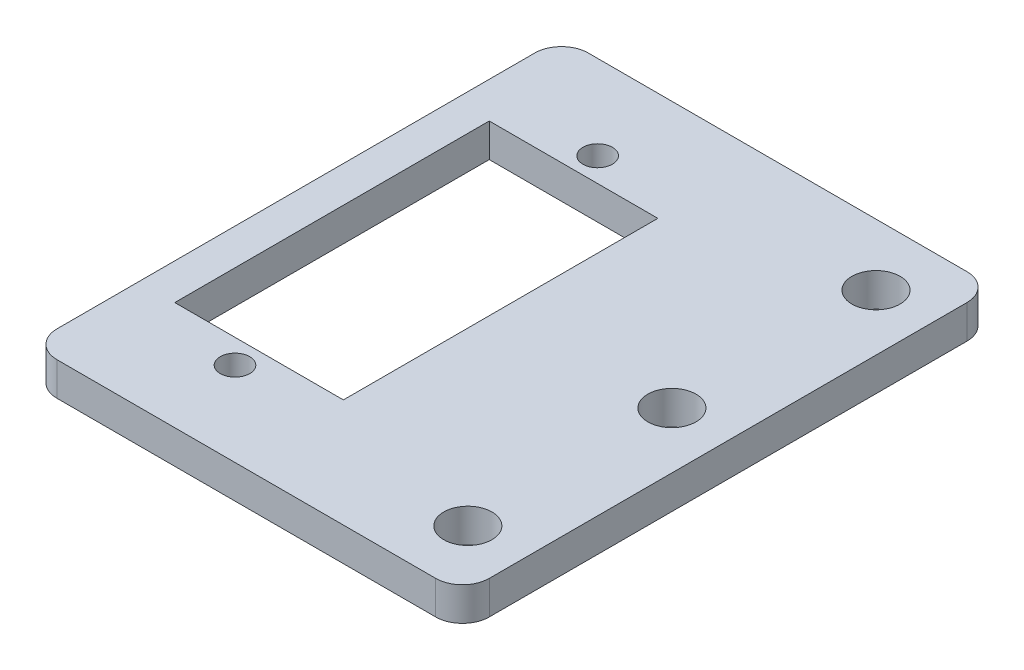
ISO-10303-21;
HEADER;
FILE_DESCRIPTION(('STEP AP214'),'2;1');
FILE_NAME('part.step','',(''),(''),'','','');
FILE_SCHEMA(('AUTOMOTIVE_DESIGN { 1 0 10303 214 1 1 1 1 }'));
ENDSEC;
DATA;
#1=APPLICATION_CONTEXT('core data for automotive mechanical design processes');
#2=APPLICATION_PROTOCOL_DEFINITION('international standard','automotive_design',2000,#1);
#3=PRODUCT_CONTEXT('',#1,'mechanical');
#4=PRODUCT('Part','Part','',(#3));
#5=PRODUCT_RELATED_PRODUCT_CATEGORY('part','',(#4));
#6=PRODUCT_DEFINITION_FORMATION('','',#4);
#7=PRODUCT_DEFINITION_CONTEXT('part definition',#1,'design');
#8=PRODUCT_DEFINITION('design','',#6,#7);
#9=PRODUCT_DEFINITION_SHAPE('','',#8);
#10=(LENGTH_UNIT() NAMED_UNIT(*) SI_UNIT(.MILLI.,.METRE.));
#11=(NAMED_UNIT(*) PLANE_ANGLE_UNIT() SI_UNIT($,.RADIAN.));
#12=(NAMED_UNIT(*) SI_UNIT($,.STERADIAN.) SOLID_ANGLE_UNIT());
#13=UNCERTAINTY_MEASURE_WITH_UNIT(LENGTH_MEASURE(1.E-05),#10,'distance_accuracy_value','');
#14=(GEOMETRIC_REPRESENTATION_CONTEXT(3) GLOBAL_UNCERTAINTY_ASSIGNED_CONTEXT((#13)) GLOBAL_UNIT_ASSIGNED_CONTEXT((#10,
#11,#12)) REPRESENTATION_CONTEXT('',''));
#15=CARTESIAN_POINT('',(0.,0.,0.));
#16=DIRECTION('',(0.,0.,1.));
#17=DIRECTION('',(1.,0.,0.));
#18=AXIS2_PLACEMENT_3D('',#15,#16,#17);
#19=CARTESIAN_POINT('',(0.,-2.5,0.));
#20=DIRECTION('',(0.,-1.,0.));
#21=DIRECTION('',(0.,0.,-1.));
#22=AXIS2_PLACEMENT_3D('',#19,#20,#21);
#23=PLANE('',#22);
#24=CARTESIAN_POINT('',(19.099999994,-2.5,15.25));
#25=DIRECTION('',(0.,1.,0.));
#26=DIRECTION('',(0.,0.,1.));
#27=AXIS2_PLACEMENT_3D('',#24,#25,#26);
#28=CIRCLE('',#27,1.8);
#29=CARTESIAN_POINT('',(19.099999994,-2.5,17.05));
#30=VERTEX_POINT('',#29);
#31=EDGE_CURVE('E449',#30,#30,#28,.T.);
#32=ORIENTED_EDGE('',*,*,#31,.T.);
#33=EDGE_LOOP('',(#32));
#34=FACE_BOUND('',#33,.T.);
#35=CARTESIAN_POINT('',(19.099999994,-2.5,0.));
#36=DIRECTION('',(0.,1.,0.));
#37=DIRECTION('',(0.,0.,1.));
#38=AXIS2_PLACEMENT_3D('',#35,#36,#37);
#39=CIRCLE('',#38,1.8);
#40=CARTESIAN_POINT('',(19.099999994,-2.5,1.8));
#41=VERTEX_POINT('',#40);
#42=EDGE_CURVE('E443',#41,#41,#39,.T.);
#43=ORIENTED_EDGE('',*,*,#42,.T.);
#44=EDGE_LOOP('',(#43));
#45=FACE_BOUND('',#44,.T.);
#46=CARTESIAN_POINT('',(19.099999994,-2.5,-15.25));
#47=DIRECTION('',(0.,1.,0.));
#48=DIRECTION('',(0.,0.,1.));
#49=AXIS2_PLACEMENT_3D('',#46,#47,#48);
#50=CIRCLE('',#49,1.8);
#51=CARTESIAN_POINT('',(19.099999994,-2.5,-13.45));
#52=VERTEX_POINT('',#51);
#53=EDGE_CURVE('E437',#52,#52,#50,.T.);
#54=ORIENTED_EDGE('',*,*,#53,.T.);
#55=EDGE_LOOP('',(#54));
#56=FACE_BOUND('',#55,.T.);
#57=CARTESIAN_POINT('',(0.,-2.5,13.55));
#58=DIRECTION('',(0.,1.,0.));
#59=DIRECTION('',(0.,0.,1.));
#60=AXIS2_PLACEMENT_3D('',#57,#58,#59);
#61=CIRCLE('',#60,1.1);
#62=CARTESIAN_POINT('',(0.,-2.5,14.65));
#63=VERTEX_POINT('',#62);
#64=EDGE_CURVE('E430',#63,#63,#61,.T.);
#65=ORIENTED_EDGE('',*,*,#64,.T.);
#66=EDGE_LOOP('',(#65));
#67=FACE_BOUND('',#66,.T.);
#68=DIRECTION('',(0.,0.,-1.));
#69=VECTOR('',#68,1.);
#70=CARTESIAN_POINT('',(23.299999994,-2.5,19.85));
#71=LINE('',#70,#69);
#72=CARTESIAN_POINT('',(23.299999994,-2.5,17.85));
#73=VERTEX_POINT('',#72);
#74=CARTESIAN_POINT('',(23.299999994,-2.5,-17.85));
#75=VERTEX_POINT('',#74);
#76=EDGE_CURVE('E177',#73,#75,#71,.T.);
#77=ORIENTED_EDGE('',*,*,#76,.F.);
#78=CARTESIAN_POINT('',(21.299999994,-2.5,17.85));
#79=DIRECTION('',(0.,-1.,0.));
#80=DIRECTION('',(0.,0.,-1.));
#81=AXIS2_PLACEMENT_3D('',#78,#79,#80);
#82=CIRCLE('',#81,2.);
#83=CARTESIAN_POINT('',(21.299999994,-2.5,19.85));
#84=VERTEX_POINT('',#83);
#85=EDGE_CURVE('E215',#73,#84,#82,.T.);
#86=ORIENTED_EDGE('',*,*,#85,.T.);
#87=DIRECTION('',(1.,0.,0.));
#88=VECTOR('',#87,1.);
#89=CARTESIAN_POINT('',(-9.,-2.5,19.85));
#90=LINE('',#89,#88);
#91=CARTESIAN_POINT('',(-7.,-2.5,19.85));
#92=VERTEX_POINT('',#91);
#93=EDGE_CURVE('E173',#92,#84,#90,.T.);
#94=ORIENTED_EDGE('',*,*,#93,.F.);
#95=CARTESIAN_POINT('',(-7.,-2.5,17.85));
#96=DIRECTION('',(0.,-1.,0.));
#97=DIRECTION('',(0.,0.,-1.));
#98=AXIS2_PLACEMENT_3D('',#95,#96,#97);
#99=CIRCLE('',#98,2.);
#100=CARTESIAN_POINT('',(-9.,-2.5,17.85));
#101=VERTEX_POINT('',#100);
#102=EDGE_CURVE('E210',#92,#101,#99,.T.);
#103=ORIENTED_EDGE('',*,*,#102,.T.);
#104=DIRECTION('',(0.,0.,1.));
#105=VECTOR('',#104,1.);
#106=CARTESIAN_POINT('',(-9.,-2.5,19.85));
#107=LINE('',#106,#105);
#108=CARTESIAN_POINT('',(-9.,-2.5,-17.85));
#109=VERTEX_POINT('',#108);
#110=EDGE_CURVE('E170',#109,#101,#107,.T.);
#111=ORIENTED_EDGE('',*,*,#110,.F.);
#112=CARTESIAN_POINT('',(-7.,-2.5,-17.85));
#113=DIRECTION('',(0.,-1.,0.));
#114=DIRECTION('',(0.,0.,-1.));
#115=AXIS2_PLACEMENT_3D('',#112,#113,#114);
#116=CIRCLE('',#115,2.);
#117=CARTESIAN_POINT('',(-7.,-2.5,-19.85));
#118=VERTEX_POINT('',#117);
#119=EDGE_CURVE('E49',#109,#118,#116,.T.);
#120=ORIENTED_EDGE('',*,*,#119,.T.);
#121=DIRECTION('',(-1.,0.,0.));
#122=VECTOR('',#121,1.);
#123=CARTESIAN_POINT('',(-9.,-2.5,-19.85));
#124=LINE('',#123,#122);
#125=CARTESIAN_POINT('',(21.299999994,-2.5,-19.85));
#126=VERTEX_POINT('',#125);
#127=EDGE_CURVE('E180',#126,#118,#124,.T.);
#128=ORIENTED_EDGE('',*,*,#127,.F.);
#129=CARTESIAN_POINT('',(21.299999994,-2.5,-17.85));
#130=DIRECTION('',(0.,-1.,0.));
#131=DIRECTION('',(0.,0.,-1.));
#132=AXIS2_PLACEMENT_3D('',#129,#130,#131);
#133=CIRCLE('',#132,2.);
#134=EDGE_CURVE('E213',#126,#75,#133,.T.);
#135=ORIENTED_EDGE('',*,*,#134,.T.);
#136=EDGE_LOOP('',(#77,#86,#94,#103,#111,#120,#128,#135));
#137=FACE_BOUND('',#136,.T.);
#138=DIRECTION('',(0.,0.,1.));
#139=VECTOR('',#138,1.);
#140=CARTESIAN_POINT('',(-6.3,-2.5,11.75));
#141=LINE('',#140,#139);
#142=CARTESIAN_POINT('',(-6.3,-2.5,-11.75));
#143=VERTEX_POINT('',#142);
#144=CARTESIAN_POINT('',(-6.3,-2.5,11.75));
#145=VERTEX_POINT('',#144);
#146=EDGE_CURVE('E128',#143,#145,#141,.T.);
#147=ORIENTED_EDGE('',*,*,#146,.T.);
#148=DIRECTION('',(1.,0.,0.));
#149=VECTOR('',#148,1.);
#150=CARTESIAN_POINT('',(-6.3,-2.5,11.75));
#151=LINE('',#150,#149);
#152=CARTESIAN_POINT('',(6.3,-2.5,11.75));
#153=VERTEX_POINT('',#152);
#154=EDGE_CURVE('E140',#145,#153,#151,.T.);
#155=ORIENTED_EDGE('',*,*,#154,.T.);
#156=DIRECTION('',(0.,0.,-1.));
#157=VECTOR('',#156,1.);
#158=CARTESIAN_POINT('',(6.3,-2.5,11.75));
#159=LINE('',#158,#157);
#160=CARTESIAN_POINT('',(6.3,-2.5,-11.75));
#161=VERTEX_POINT('',#160);
#162=EDGE_CURVE('E144',#153,#161,#159,.T.);
#163=ORIENTED_EDGE('',*,*,#162,.T.);
#164=DIRECTION('',(-1.,0.,0.));
#165=VECTOR('',#164,1.);
#166=CARTESIAN_POINT('',(-6.3,-2.5,-11.75));
#167=LINE('',#166,#165);
#168=EDGE_CURVE('E136',#161,#143,#167,.T.);
#169=ORIENTED_EDGE('',*,*,#168,.T.);
#170=EDGE_LOOP('',(#147,#155,#163,#169));
#171=FACE_BOUND('',#170,.T.);
#172=CARTESIAN_POINT('',(0.,-2.5,-13.55));
#173=DIRECTION('',(0.,1.,0.));
#174=DIRECTION('',(0.,0.,1.));
#175=AXIS2_PLACEMENT_3D('',#172,#173,#174);
#176=CIRCLE('',#175,1.1);
#177=CARTESIAN_POINT('',(0.,-2.5,-12.45));
#178=VERTEX_POINT('',#177);
#179=EDGE_CURVE('E154',#178,#178,#176,.T.);
#180=ORIENTED_EDGE('',*,*,#179,.T.);
#181=EDGE_LOOP('',(#180));
#182=FACE_BOUND('',#181,.T.);
#183=ADVANCED_FACE('F34',(#34,#45,#56,#67,#137,#171,#182),#23,.T.);
#184=CARTESIAN_POINT('',(0.,0.,0.));
#185=DIRECTION('',(0.,-1.,0.));
#186=DIRECTION('',(0.,0.,-1.));
#187=AXIS2_PLACEMENT_3D('',#184,#185,#186);
#188=PLANE('',#187);
#189=CARTESIAN_POINT('',(19.099999994,0.,15.25));
#190=DIRECTION('',(0.,1.,0.));
#191=DIRECTION('',(0.,0.,1.));
#192=AXIS2_PLACEMENT_3D('',#189,#190,#191);
#193=CIRCLE('',#192,1.8);
#194=CARTESIAN_POINT('',(19.099999994,0.,17.05));
#195=VERTEX_POINT('',#194);
#196=EDGE_CURVE('E451',#195,#195,#193,.T.);
#197=ORIENTED_EDGE('',*,*,#196,.F.);
#198=EDGE_LOOP('',(#197));
#199=FACE_BOUND('',#198,.T.);
#200=CARTESIAN_POINT('',(19.099999994,0.,0.));
#201=DIRECTION('',(0.,1.,0.));
#202=DIRECTION('',(0.,0.,1.));
#203=AXIS2_PLACEMENT_3D('',#200,#201,#202);
#204=CIRCLE('',#203,1.8);
#205=CARTESIAN_POINT('',(19.099999994,0.,1.8));
#206=VERTEX_POINT('',#205);
#207=EDGE_CURVE('E446',#206,#206,#204,.T.);
#208=ORIENTED_EDGE('',*,*,#207,.F.);
#209=EDGE_LOOP('',(#208));
#210=FACE_BOUND('',#209,.T.);
#211=CARTESIAN_POINT('',(19.099999994,0.,-15.25));
#212=DIRECTION('',(0.,1.,0.));
#213=DIRECTION('',(0.,0.,1.));
#214=AXIS2_PLACEMENT_3D('',#211,#212,#213);
#215=CIRCLE('',#214,1.8);
#216=CARTESIAN_POINT('',(19.099999994,0.,-13.45));
#217=VERTEX_POINT('',#216);
#218=EDGE_CURVE('E440',#217,#217,#215,.T.);
#219=ORIENTED_EDGE('',*,*,#218,.F.);
#220=EDGE_LOOP('',(#219));
#221=FACE_BOUND('',#220,.T.);
#222=CARTESIAN_POINT('',(0.,0.,13.55));
#223=DIRECTION('',(0.,1.,0.));
#224=DIRECTION('',(0.,0.,1.));
#225=AXIS2_PLACEMENT_3D('',#222,#223,#224);
#226=CIRCLE('',#225,1.09999999999999);
#227=CARTESIAN_POINT('',(0.,0.,14.65));
#228=VERTEX_POINT('',#227);
#229=EDGE_CURVE('E432',#228,#228,#226,.T.);
#230=ORIENTED_EDGE('',*,*,#229,.F.);
#231=EDGE_LOOP('',(#230));
#232=FACE_BOUND('',#231,.T.);
#233=DIRECTION('',(1.,0.,0.));
#234=VECTOR('',#233,1.);
#235=CARTESIAN_POINT('',(-6.3,0.,11.75));
#236=LINE('',#235,#234);
#237=CARTESIAN_POINT('',(-6.3,0.,11.75));
#238=VERTEX_POINT('',#237);
#239=CARTESIAN_POINT('',(6.3,0.,11.75));
#240=VERTEX_POINT('',#239);
#241=EDGE_CURVE('E160',#238,#240,#236,.T.);
#242=ORIENTED_EDGE('',*,*,#241,.F.);
#243=DIRECTION('',(0.,0.,1.));
#244=VECTOR('',#243,1.);
#245=CARTESIAN_POINT('',(-6.3,0.,11.75));
#246=LINE('',#245,#244);
#247=CARTESIAN_POINT('',(-6.3,0.,-11.75));
#248=VERTEX_POINT('',#247);
#249=EDGE_CURVE('E131',#248,#238,#246,.T.);
#250=ORIENTED_EDGE('',*,*,#249,.F.);
#251=DIRECTION('',(-1.,0.,0.));
#252=VECTOR('',#251,1.);
#253=CARTESIAN_POINT('',(-6.3,0.,-11.75));
#254=LINE('',#253,#252);
#255=CARTESIAN_POINT('',(6.3,0.,-11.75));
#256=VERTEX_POINT('',#255);
#257=EDGE_CURVE('E148',#256,#248,#254,.T.);
#258=ORIENTED_EDGE('',*,*,#257,.F.);
#259=DIRECTION('',(0.,0.,-1.));
#260=VECTOR('',#259,1.);
#261=CARTESIAN_POINT('',(6.3,0.,11.75));
#262=LINE('',#261,#260);
#263=EDGE_CURVE('E151',#240,#256,#262,.T.);
#264=ORIENTED_EDGE('',*,*,#263,.F.);
#265=EDGE_LOOP('',(#242,#250,#258,#264));
#266=FACE_BOUND('',#265,.T.);
#267=DIRECTION('',(1.,0.,0.));
#268=VECTOR('',#267,1.);
#269=CARTESIAN_POINT('',(-9.,0.,19.85));
#270=LINE('',#269,#268);
#271=CARTESIAN_POINT('',(-7.,0.,19.85));
#272=VERTEX_POINT('',#271);
#273=CARTESIAN_POINT('',(21.299999994,0.,19.85));
#274=VERTEX_POINT('',#273);
#275=EDGE_CURVE('E185',#272,#274,#270,.T.);
#276=ORIENTED_EDGE('',*,*,#275,.T.);
#277=CARTESIAN_POINT('',(21.299999994,0.,17.85));
#278=DIRECTION('',(0.,-1.,0.));
#279=DIRECTION('',(0.,0.,-1.));
#280=AXIS2_PLACEMENT_3D('',#277,#278,#279);
#281=CIRCLE('',#280,2.);
#282=CARTESIAN_POINT('',(23.299999994,0.,17.85));
#283=VERTEX_POINT('',#282);
#284=EDGE_CURVE('E203',#274,#283,#281,.F.);
#285=ORIENTED_EDGE('',*,*,#284,.T.);
#286=DIRECTION('',(0.,0.,-1.));
#287=VECTOR('',#286,1.);
#288=CARTESIAN_POINT('',(23.299999994,0.,19.85));
#289=LINE('',#288,#287);
#290=CARTESIAN_POINT('',(23.299999994,0.,-17.85));
#291=VERTEX_POINT('',#290);
#292=EDGE_CURVE('E188',#283,#291,#289,.T.);
#293=ORIENTED_EDGE('',*,*,#292,.T.);
#294=CARTESIAN_POINT('',(21.299999994,0.,-17.85));
#295=DIRECTION('',(0.,-1.,0.));
#296=DIRECTION('',(0.,0.,-1.));
#297=AXIS2_PLACEMENT_3D('',#294,#295,#296);
#298=CIRCLE('',#297,2.);
#299=CARTESIAN_POINT('',(21.299999994,0.,-19.85));
#300=VERTEX_POINT('',#299);
#301=EDGE_CURVE('E201',#291,#300,#298,.F.);
#302=ORIENTED_EDGE('',*,*,#301,.T.);
#303=DIRECTION('',(-1.,0.,0.));
#304=VECTOR('',#303,1.);
#305=CARTESIAN_POINT('',(-9.,0.,-19.85));
#306=LINE('',#305,#304);
#307=CARTESIAN_POINT('',(-7.,0.,-19.85));
#308=VERTEX_POINT('',#307);
#309=EDGE_CURVE('E174',#300,#308,#306,.T.);
#310=ORIENTED_EDGE('',*,*,#309,.T.);
#311=CARTESIAN_POINT('',(-7.,0.,-17.85));
#312=DIRECTION('',(0.,-1.,0.));
#313=DIRECTION('',(0.,0.,-1.));
#314=AXIS2_PLACEMENT_3D('',#311,#312,#313);
#315=CIRCLE('',#314,2.);
#316=CARTESIAN_POINT('',(-9.,0.,-17.85));
#317=VERTEX_POINT('',#316);
#318=EDGE_CURVE('E199',#308,#317,#315,.F.);
#319=ORIENTED_EDGE('',*,*,#318,.T.);
#320=DIRECTION('',(0.,0.,1.));
#321=VECTOR('',#320,1.);
#322=CARTESIAN_POINT('',(-9.,0.,19.85));
#323=LINE('',#322,#321);
#324=CARTESIAN_POINT('',(-9.,0.,17.85));
#325=VERTEX_POINT('',#324);
#326=EDGE_CURVE('E166',#317,#325,#323,.T.);
#327=ORIENTED_EDGE('',*,*,#326,.T.);
#328=CARTESIAN_POINT('',(-7.,0.,17.85));
#329=DIRECTION('',(0.,-1.,0.));
#330=DIRECTION('',(0.,0.,-1.));
#331=AXIS2_PLACEMENT_3D('',#328,#329,#330);
#332=CIRCLE('',#331,2.);
#333=EDGE_CURVE('E197',#325,#272,#332,.F.);
#334=ORIENTED_EDGE('',*,*,#333,.T.);
#335=EDGE_LOOP('',(#276,#285,#293,#302,#310,#319,#327,#334));
#336=FACE_BOUND('',#335,.T.);
#337=CARTESIAN_POINT('',(0.,0.,-13.55));
#338=DIRECTION('',(0.,1.,0.));
#339=DIRECTION('',(0.,0.,1.));
#340=AXIS2_PLACEMENT_3D('',#337,#338,#339);
#341=CIRCLE('',#340,1.09999999999999);
#342=CARTESIAN_POINT('',(0.,0.,-12.45));
#343=VERTEX_POINT('',#342);
#344=EDGE_CURVE('E429',#343,#343,#341,.T.);
#345=ORIENTED_EDGE('',*,*,#344,.F.);
#346=EDGE_LOOP('',(#345));
#347=FACE_BOUND('',#346,.T.);
#348=ADVANCED_FACE('F229',(#199,#210,#221,#232,#266,#336,#347),#188,.F.);
#349=CARTESIAN_POINT('',(-9.,-2.5,19.85));
#350=DIRECTION('',(-1.,0.,0.));
#351=DIRECTION('',(0.,0.,1.));
#352=AXIS2_PLACEMENT_3D('',#349,#350,#351);
#353=PLANE('',#352);
#354=ORIENTED_EDGE('',*,*,#326,.F.);
#355=DIRECTION('',(0.,1.,0.));
#356=VECTOR('',#355,1.);
#357=CARTESIAN_POINT('',(-9.,-2.5,-17.85));
#358=LINE('',#357,#356);
#359=EDGE_CURVE('E11',#317,#109,#358,.F.);
#360=ORIENTED_EDGE('',*,*,#359,.T.);
#361=ORIENTED_EDGE('',*,*,#110,.T.);
#362=DIRECTION('',(0.,1.,0.));
#363=VECTOR('',#362,1.);
#364=CARTESIAN_POINT('',(-9.,-2.5,17.85));
#365=LINE('',#364,#363);
#366=EDGE_CURVE('E42',#101,#325,#365,.T.);
#367=ORIENTED_EDGE('',*,*,#366,.T.);
#368=EDGE_LOOP('',(#354,#360,#361,#367));
#369=FACE_BOUND('',#368,.T.);
#370=ADVANCED_FACE('F224',(#369),#353,.T.);
#371=CARTESIAN_POINT('',(-9.,-2.5,-19.85));
#372=DIRECTION('',(0.,0.,-1.));
#373=DIRECTION('',(-1.,0.,0.));
#374=AXIS2_PLACEMENT_3D('',#371,#372,#373);
#375=PLANE('',#374);
#376=ORIENTED_EDGE('',*,*,#309,.F.);
#377=DIRECTION('',(0.,1.,0.));
#378=VECTOR('',#377,1.);
#379=CARTESIAN_POINT('',(21.299999994,-2.5,-19.85));
#380=LINE('',#379,#378);
#381=EDGE_CURVE('E56',#300,#126,#380,.F.);
#382=ORIENTED_EDGE('',*,*,#381,.T.);
#383=ORIENTED_EDGE('',*,*,#127,.T.);
#384=DIRECTION('',(0.,1.,0.));
#385=VECTOR('',#384,1.);
#386=CARTESIAN_POINT('',(-7.,-2.5,-19.85));
#387=LINE('',#386,#385);
#388=EDGE_CURVE('E217',#118,#308,#387,.T.);
#389=ORIENTED_EDGE('',*,*,#388,.T.);
#390=EDGE_LOOP('',(#376,#382,#383,#389));
#391=FACE_BOUND('',#390,.T.);
#392=ADVANCED_FACE('F235',(#391),#375,.T.);
#393=CARTESIAN_POINT('',(23.299999994,-2.5,19.85));
#394=DIRECTION('',(1.,0.,0.));
#395=DIRECTION('',(0.,0.,-1.));
#396=AXIS2_PLACEMENT_3D('',#393,#394,#395);
#397=PLANE('',#396);
#398=ORIENTED_EDGE('',*,*,#292,.F.);
#399=DIRECTION('',(0.,1.,0.));
#400=VECTOR('',#399,1.);
#401=CARTESIAN_POINT('',(23.299999994,-2.5,17.85));
#402=LINE('',#401,#400);
#403=EDGE_CURVE('E208',#283,#73,#402,.F.);
#404=ORIENTED_EDGE('',*,*,#403,.T.);
#405=ORIENTED_EDGE('',*,*,#76,.T.);
#406=DIRECTION('',(0.,1.,0.));
#407=VECTOR('',#406,1.);
#408=CARTESIAN_POINT('',(23.299999994,-2.5,-17.85));
#409=LINE('',#408,#407);
#410=EDGE_CURVE('E205',#75,#291,#409,.T.);
#411=ORIENTED_EDGE('',*,*,#410,.T.);
#412=EDGE_LOOP('',(#398,#404,#405,#411));
#413=FACE_BOUND('',#412,.T.);
#414=ADVANCED_FACE('F243',(#413),#397,.T.);
#415=CARTESIAN_POINT('',(-9.,-2.5,19.85));
#416=DIRECTION('',(0.,0.,1.));
#417=DIRECTION('',(1.,0.,0.));
#418=AXIS2_PLACEMENT_3D('',#415,#416,#417);
#419=PLANE('',#418);
#420=ORIENTED_EDGE('',*,*,#93,.T.);
#421=DIRECTION('',(0.,1.,0.));
#422=VECTOR('',#421,1.);
#423=CARTESIAN_POINT('',(21.299999994,-2.5,19.85));
#424=LINE('',#423,#422);
#425=EDGE_CURVE('E194',#84,#274,#424,.T.);
#426=ORIENTED_EDGE('',*,*,#425,.T.);
#427=ORIENTED_EDGE('',*,*,#275,.F.);
#428=DIRECTION('',(0.,1.,0.));
#429=VECTOR('',#428,1.);
#430=CARTESIAN_POINT('',(-7.,-2.5,19.85));
#431=LINE('',#430,#429);
#432=EDGE_CURVE('E182',#272,#92,#431,.F.);
#433=ORIENTED_EDGE('',*,*,#432,.T.);
#434=EDGE_LOOP('',(#420,#426,#427,#433));
#435=FACE_BOUND('',#434,.T.);
#436=ADVANCED_FACE('F250',(#435),#419,.T.);
#437=CARTESIAN_POINT('',(-6.3,-2.5,11.75));
#438=DIRECTION('',(-1.,0.,0.));
#439=DIRECTION('',(0.,0.,1.));
#440=AXIS2_PLACEMENT_3D('',#437,#438,#439);
#441=PLANE('',#440);
#442=ORIENTED_EDGE('',*,*,#249,.T.);
#443=DIRECTION('',(0.,1.,0.));
#444=VECTOR('',#443,1.);
#445=CARTESIAN_POINT('',(-6.3,-2.5,11.75));
#446=LINE('',#445,#444);
#447=EDGE_CURVE('E124',#145,#238,#446,.T.);
#448=ORIENTED_EDGE('',*,*,#447,.F.);
#449=ORIENTED_EDGE('',*,*,#146,.F.);
#450=DIRECTION('',(0.,1.,0.));
#451=VECTOR('',#450,1.);
#452=CARTESIAN_POINT('',(-6.3,-2.5,-11.75));
#453=LINE('',#452,#451);
#454=EDGE_CURVE('E164',#143,#248,#453,.T.);
#455=ORIENTED_EDGE('',*,*,#454,.T.);
#456=EDGE_LOOP('',(#442,#448,#449,#455));
#457=FACE_BOUND('',#456,.T.);
#458=ADVANCED_FACE('F126',(#457),#441,.F.);
#459=CARTESIAN_POINT('',(-6.3,-2.5,-11.75));
#460=DIRECTION('',(0.,0.,-1.));
#461=DIRECTION('',(-1.,0.,0.));
#462=AXIS2_PLACEMENT_3D('',#459,#460,#461);
#463=PLANE('',#462);
#464=ORIENTED_EDGE('',*,*,#257,.T.);
#465=ORIENTED_EDGE('',*,*,#454,.F.);
#466=ORIENTED_EDGE('',*,*,#168,.F.);
#467=DIRECTION('',(0.,1.,0.));
#468=VECTOR('',#467,1.);
#469=CARTESIAN_POINT('',(6.3,-2.5,-11.75));
#470=LINE('',#469,#468);
#471=EDGE_CURVE('E167',#161,#256,#470,.T.);
#472=ORIENTED_EDGE('',*,*,#471,.T.);
#473=EDGE_LOOP('',(#464,#465,#466,#472));
#474=FACE_BOUND('',#473,.T.);
#475=ADVANCED_FACE('F372',(#474),#463,.F.);
#476=CARTESIAN_POINT('',(6.3,-2.5,11.75));
#477=DIRECTION('',(1.,0.,0.));
#478=DIRECTION('',(0.,0.,-1.));
#479=AXIS2_PLACEMENT_3D('',#476,#477,#478);
#480=PLANE('',#479);
#481=ORIENTED_EDGE('',*,*,#263,.T.);
#482=ORIENTED_EDGE('',*,*,#471,.F.);
#483=ORIENTED_EDGE('',*,*,#162,.F.);
#484=DIRECTION('',(0.,1.,0.));
#485=VECTOR('',#484,1.);
#486=CARTESIAN_POINT('',(6.3,-2.5,11.75));
#487=LINE('',#486,#485);
#488=EDGE_CURVE('E135',#153,#240,#487,.T.);
#489=ORIENTED_EDGE('',*,*,#488,.T.);
#490=EDGE_LOOP('',(#481,#482,#483,#489));
#491=FACE_BOUND('',#490,.T.);
#492=ADVANCED_FACE('F365',(#491),#480,.F.);
#493=CARTESIAN_POINT('',(-6.3,-2.5,11.75));
#494=DIRECTION('',(0.,0.,1.));
#495=DIRECTION('',(1.,0.,0.));
#496=AXIS2_PLACEMENT_3D('',#493,#494,#495);
#497=PLANE('',#496);
#498=ORIENTED_EDGE('',*,*,#241,.T.);
#499=ORIENTED_EDGE('',*,*,#488,.F.);
#500=ORIENTED_EDGE('',*,*,#154,.F.);
#501=ORIENTED_EDGE('',*,*,#447,.T.);
#502=EDGE_LOOP('',(#498,#499,#500,#501));
#503=FACE_BOUND('',#502,.T.);
#504=ADVANCED_FACE('F141',(#503),#497,.F.);
#505=CARTESIAN_POINT('',(0.,0.,-13.55));
#506=DIRECTION('',(0.,1.,0.));
#507=DIRECTION('',(0.,0.,1.));
#508=AXIS2_PLACEMENT_3D('',#505,#506,#507);
#509=CYLINDRICAL_SURFACE('',#508,1.09999999999999);
#510=ORIENTED_EDGE('',*,*,#179,.F.);
#511=EDGE_LOOP('',(#510));
#512=FACE_BOUND('',#511,.T.);
#513=ORIENTED_EDGE('',*,*,#344,.T.);
#514=EDGE_LOOP('',(#513));
#515=FACE_BOUND('',#514,.T.);
#516=ADVANCED_FACE('F338',(#512,#515),#509,.F.);
#517=CARTESIAN_POINT('',(0.,0.,13.55));
#518=DIRECTION('',(0.,1.,0.));
#519=DIRECTION('',(0.,0.,1.));
#520=AXIS2_PLACEMENT_3D('',#517,#518,#519);
#521=CYLINDRICAL_SURFACE('',#520,1.09999999999999);
#522=ORIENTED_EDGE('',*,*,#64,.F.);
#523=EDGE_LOOP('',(#522));
#524=FACE_BOUND('',#523,.T.);
#525=ORIENTED_EDGE('',*,*,#229,.T.);
#526=EDGE_LOOP('',(#525));
#527=FACE_BOUND('',#526,.T.);
#528=ADVANCED_FACE('F329',(#524,#527),#521,.F.);
#529=CARTESIAN_POINT('',(19.099999994,0.,-15.25));
#530=DIRECTION('',(0.,1.,0.));
#531=DIRECTION('',(0.,0.,1.));
#532=AXIS2_PLACEMENT_3D('',#529,#530,#531);
#533=CYLINDRICAL_SURFACE('',#532,1.8);
#534=ORIENTED_EDGE('',*,*,#53,.F.);
#535=EDGE_LOOP('',(#534));
#536=FACE_BOUND('',#535,.T.);
#537=ORIENTED_EDGE('',*,*,#218,.T.);
#538=EDGE_LOOP('',(#537));
#539=FACE_BOUND('',#538,.T.);
#540=ADVANCED_FACE('F320',(#536,#539),#533,.F.);
#541=CARTESIAN_POINT('',(19.099999994,0.,0.));
#542=DIRECTION('',(0.,1.,0.));
#543=DIRECTION('',(0.,0.,1.));
#544=AXIS2_PLACEMENT_3D('',#541,#542,#543);
#545=CYLINDRICAL_SURFACE('',#544,1.8);
#546=ORIENTED_EDGE('',*,*,#42,.F.);
#547=EDGE_LOOP('',(#546));
#548=FACE_BOUND('',#547,.T.);
#549=ORIENTED_EDGE('',*,*,#207,.T.);
#550=EDGE_LOOP('',(#549));
#551=FACE_BOUND('',#550,.T.);
#552=ADVANCED_FACE('F311',(#548,#551),#545,.F.);
#553=CARTESIAN_POINT('',(19.099999994,0.,15.25));
#554=DIRECTION('',(0.,1.,0.));
#555=DIRECTION('',(0.,0.,1.));
#556=AXIS2_PLACEMENT_3D('',#553,#554,#555);
#557=CYLINDRICAL_SURFACE('',#556,1.8);
#558=ORIENTED_EDGE('',*,*,#31,.F.);
#559=EDGE_LOOP('',(#558));
#560=FACE_BOUND('',#559,.T.);
#561=ORIENTED_EDGE('',*,*,#196,.T.);
#562=EDGE_LOOP('',(#561));
#563=FACE_BOUND('',#562,.T.);
#564=ADVANCED_FACE('F280',(#560,#563),#557,.F.);
#565=CARTESIAN_POINT('',(21.299999994,-2.5,17.85));
#566=DIRECTION('',(0.,1.,0.));
#567=DIRECTION('',(0.,0.,1.));
#568=AXIS2_PLACEMENT_3D('',#565,#566,#567);
#569=CYLINDRICAL_SURFACE('',#568,2.);
#570=ORIENTED_EDGE('',*,*,#85,.F.);
#571=ORIENTED_EDGE('',*,*,#403,.F.);
#572=ORIENTED_EDGE('',*,*,#284,.F.);
#573=ORIENTED_EDGE('',*,*,#425,.F.);
#574=EDGE_LOOP('',(#570,#571,#572,#573));
#575=FACE_BOUND('',#574,.T.);
#576=ADVANCED_FACE('F248',(#575),#569,.T.);
#577=CARTESIAN_POINT('',(21.299999994,-2.5,-17.85));
#578=DIRECTION('',(0.,1.,0.));
#579=DIRECTION('',(0.,0.,1.));
#580=AXIS2_PLACEMENT_3D('',#577,#578,#579);
#581=CYLINDRICAL_SURFACE('',#580,2.);
#582=ORIENTED_EDGE('',*,*,#134,.F.);
#583=ORIENTED_EDGE('',*,*,#381,.F.);
#584=ORIENTED_EDGE('',*,*,#301,.F.);
#585=ORIENTED_EDGE('',*,*,#410,.F.);
#586=EDGE_LOOP('',(#582,#583,#584,#585));
#587=FACE_BOUND('',#586,.T.);
#588=ADVANCED_FACE('F240',(#587),#581,.T.);
#589=CARTESIAN_POINT('',(-7.,-2.5,-17.85));
#590=DIRECTION('',(0.,1.,0.));
#591=DIRECTION('',(0.,0.,1.));
#592=AXIS2_PLACEMENT_3D('',#589,#590,#591);
#593=CYLINDRICAL_SURFACE('',#592,2.);
#594=ORIENTED_EDGE('',*,*,#119,.F.);
#595=ORIENTED_EDGE('',*,*,#359,.F.);
#596=ORIENTED_EDGE('',*,*,#318,.F.);
#597=ORIENTED_EDGE('',*,*,#388,.F.);
#598=EDGE_LOOP('',(#594,#595,#596,#597));
#599=FACE_BOUND('',#598,.T.);
#600=ADVANCED_FACE('F234',(#599),#593,.T.);
#601=CARTESIAN_POINT('',(-7.,-2.5,17.85));
#602=DIRECTION('',(0.,1.,0.));
#603=DIRECTION('',(0.,0.,1.));
#604=AXIS2_PLACEMENT_3D('',#601,#602,#603);
#605=CYLINDRICAL_SURFACE('',#604,2.);
#606=ORIENTED_EDGE('',*,*,#102,.F.);
#607=ORIENTED_EDGE('',*,*,#432,.F.);
#608=ORIENTED_EDGE('',*,*,#333,.F.);
#609=ORIENTED_EDGE('',*,*,#366,.F.);
#610=EDGE_LOOP('',(#606,#607,#608,#609));
#611=FACE_BOUND('',#610,.T.);
#612=ADVANCED_FACE('F36',(#611),#605,.T.);
#613=CLOSED_SHELL('',(#183,#348,#370,#392,#414,#436,#458,#475,#492,#504,#516,#528,#540,#552,
#564,#576,#588,#600,#612));
#614=MANIFOLD_SOLID_BREP('B2',#613);
#615=ADVANCED_BREP_SHAPE_REPRESENTATION('',(#18,#614),#14);
#616=SHAPE_DEFINITION_REPRESENTATION(#9,#615);
ENDSEC;
END-ISO-10303-21;
